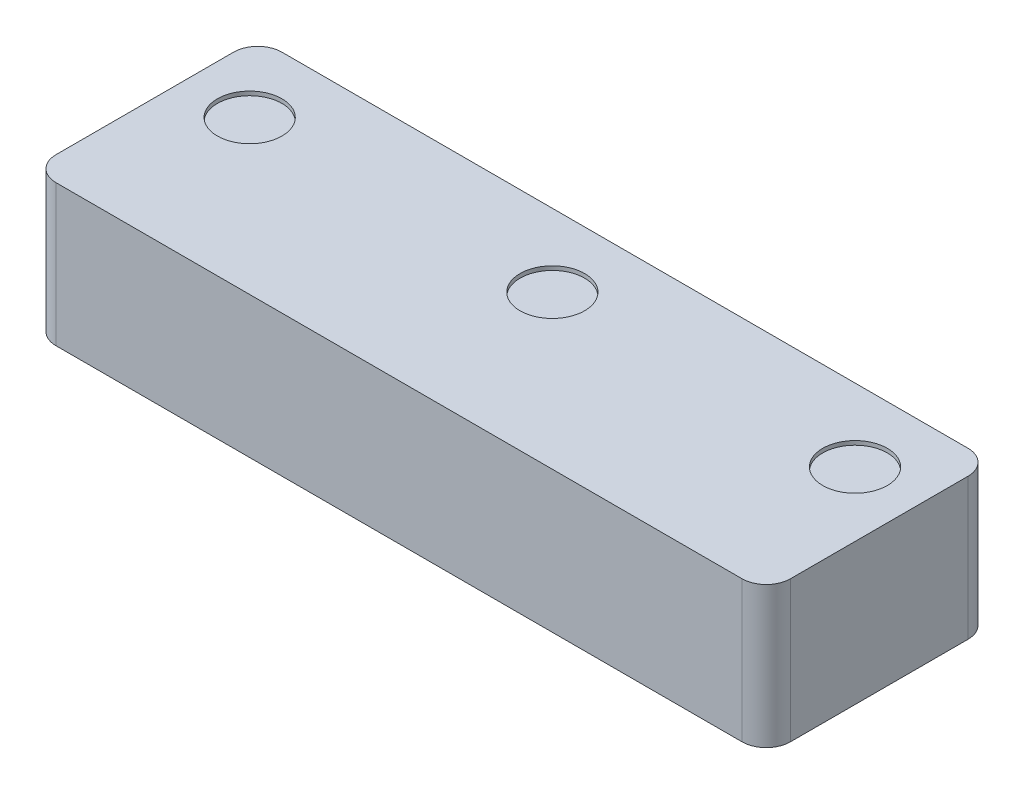
ISO-10303-21;
HEADER;
FILE_DESCRIPTION(('STEP AP214'),'2;1');
FILE_NAME('part.step','',(''),(''),'','','');
FILE_SCHEMA(('AUTOMOTIVE_DESIGN { 1 0 10303 214 1 1 1 1 }'));
ENDSEC;
DATA;
#1=APPLICATION_CONTEXT('core data for automotive mechanical design processes');
#2=APPLICATION_PROTOCOL_DEFINITION('international standard','automotive_design',2000,#1);
#3=PRODUCT_CONTEXT('',#1,'mechanical');
#4=PRODUCT('Part','Part','',(#3));
#5=PRODUCT_RELATED_PRODUCT_CATEGORY('part','',(#4));
#6=PRODUCT_DEFINITION_FORMATION('','',#4);
#7=PRODUCT_DEFINITION_CONTEXT('part definition',#1,'design');
#8=PRODUCT_DEFINITION('design','',#6,#7);
#9=PRODUCT_DEFINITION_SHAPE('','',#8);
#10=(LENGTH_UNIT() NAMED_UNIT(*) SI_UNIT(.MILLI.,.METRE.));
#11=(NAMED_UNIT(*) PLANE_ANGLE_UNIT() SI_UNIT($,.RADIAN.));
#12=(NAMED_UNIT(*) SI_UNIT($,.STERADIAN.) SOLID_ANGLE_UNIT());
#13=UNCERTAINTY_MEASURE_WITH_UNIT(LENGTH_MEASURE(1.E-05),#10,'distance_accuracy_value','');
#14=(GEOMETRIC_REPRESENTATION_CONTEXT(3) GLOBAL_UNCERTAINTY_ASSIGNED_CONTEXT((#13)) GLOBAL_UNIT_ASSIGNED_CONTEXT((#10,
#11,#12)) REPRESENTATION_CONTEXT('',''));
#15=CARTESIAN_POINT('',(0.,0.,0.));
#16=DIRECTION('',(0.,0.,1.));
#17=DIRECTION('',(1.,0.,0.));
#18=AXIS2_PLACEMENT_3D('',#15,#16,#17);
#19=CARTESIAN_POINT('',(0.,17.5,0.));
#20=DIRECTION('',(1.,0.,0.));
#21=DIRECTION('',(0.,0.,-1.));
#22=AXIS2_PLACEMENT_3D('',#19,#20,#21);
#23=PLANE('',#22);
#24=DIRECTION('',(0.,0.,1.));
#25=VECTOR('',#24,1.);
#26=CARTESIAN_POINT('',(0.,0.,0.));
#27=LINE('',#26,#25);
#28=CARTESIAN_POINT('',(0.,0.,-25.));
#29=VERTEX_POINT('',#28);
#30=CARTESIAN_POINT('',(0.,0.,-3.));
#31=VERTEX_POINT('',#30);
#32=EDGE_CURVE('E131',#29,#31,#27,.T.);
#33=ORIENTED_EDGE('',*,*,#32,.T.);
#34=DIRECTION('',(0.,-1.,0.));
#35=VECTOR('',#34,1.);
#36=CARTESIAN_POINT('',(0.,17.5,-3.));
#37=LINE('',#36,#35);
#38=CARTESIAN_POINT('',(0.,17.5,-3.));
#39=VERTEX_POINT('',#38);
#40=EDGE_CURVE('E108',#31,#39,#37,.F.);
#41=ORIENTED_EDGE('',*,*,#40,.T.);
#42=DIRECTION('',(0.,0.,1.));
#43=VECTOR('',#42,1.);
#44=CARTESIAN_POINT('',(0.,17.5,0.));
#45=LINE('',#44,#43);
#46=CARTESIAN_POINT('',(0.,17.5,-25.));
#47=VERTEX_POINT('',#46);
#48=EDGE_CURVE('E141',#47,#39,#45,.T.);
#49=ORIENTED_EDGE('',*,*,#48,.F.);
#50=DIRECTION('',(0.,-1.,0.));
#51=VECTOR('',#50,1.);
#52=CARTESIAN_POINT('',(0.,17.5,-25.));
#53=LINE('',#52,#51);
#54=EDGE_CURVE('E113',#47,#29,#53,.T.);
#55=ORIENTED_EDGE('',*,*,#54,.T.);
#56=EDGE_LOOP('',(#33,#41,#49,#55));
#57=FACE_BOUND('',#56,.T.);
#58=ADVANCED_FACE('F36',(#57),#23,.F.);
#59=CARTESIAN_POINT('',(0.,17.5,0.));
#60=DIRECTION('',(0.,0.,-1.));
#61=DIRECTION('',(-1.,0.,0.));
#62=AXIS2_PLACEMENT_3D('',#59,#60,#61);
#63=PLANE('',#62);
#64=DIRECTION('',(1.,0.,0.));
#65=VECTOR('',#64,1.);
#66=CARTESIAN_POINT('',(0.,17.5,0.));
#67=LINE('',#66,#65);
#68=CARTESIAN_POINT('',(3.,17.5,0.));
#69=VERTEX_POINT('',#68);
#70=CARTESIAN_POINT('',(88.,17.5,0.));
#71=VERTEX_POINT('',#70);
#72=EDGE_CURVE('E123',#69,#71,#67,.T.);
#73=ORIENTED_EDGE('',*,*,#72,.F.);
#74=DIRECTION('',(0.,-1.,0.));
#75=VECTOR('',#74,1.);
#76=CARTESIAN_POINT('',(3.,17.5,0.));
#77=LINE('',#76,#75);
#78=CARTESIAN_POINT('',(3.,0.,0.));
#79=VERTEX_POINT('',#78);
#80=EDGE_CURVE('E107',#69,#79,#77,.T.);
#81=ORIENTED_EDGE('',*,*,#80,.T.);
#82=DIRECTION('',(1.,0.,0.));
#83=VECTOR('',#82,1.);
#84=CARTESIAN_POINT('',(0.,0.,0.));
#85=LINE('',#84,#83);
#86=CARTESIAN_POINT('',(88.,0.,0.));
#87=VERTEX_POINT('',#86);
#88=EDGE_CURVE('E120',#79,#87,#85,.T.);
#89=ORIENTED_EDGE('',*,*,#88,.T.);
#90=DIRECTION('',(0.,-1.,0.));
#91=VECTOR('',#90,1.);
#92=CARTESIAN_POINT('',(88.,17.5,0.));
#93=LINE('',#92,#91);
#94=EDGE_CURVE('E125',#87,#71,#93,.F.);
#95=ORIENTED_EDGE('',*,*,#94,.T.);
#96=EDGE_LOOP('',(#73,#81,#89,#95));
#97=FACE_BOUND('',#96,.T.);
#98=ADVANCED_FACE('F119',(#97),#63,.F.);
#99=CARTESIAN_POINT('',(91.,17.5,0.));
#100=DIRECTION('',(-1.,0.,0.));
#101=DIRECTION('',(0.,0.,1.));
#102=AXIS2_PLACEMENT_3D('',#99,#100,#101);
#103=PLANE('',#102);
#104=DIRECTION('',(0.,0.,-1.));
#105=VECTOR('',#104,1.);
#106=CARTESIAN_POINT('',(91.,17.5,0.));
#107=LINE('',#106,#105);
#108=CARTESIAN_POINT('',(91.,17.5,-3.));
#109=VERTEX_POINT('',#108);
#110=CARTESIAN_POINT('',(91.,17.5,-25.));
#111=VERTEX_POINT('',#110);
#112=EDGE_CURVE('E164',#109,#111,#107,.T.);
#113=ORIENTED_EDGE('',*,*,#112,.F.);
#114=DIRECTION('',(0.,-1.,0.));
#115=VECTOR('',#114,1.);
#116=CARTESIAN_POINT('',(91.,17.5,-3.));
#117=LINE('',#116,#115);
#118=CARTESIAN_POINT('',(91.,0.,-3.));
#119=VERTEX_POINT('',#118);
#120=EDGE_CURVE('E11',#109,#119,#117,.T.);
#121=ORIENTED_EDGE('',*,*,#120,.T.);
#122=DIRECTION('',(0.,0.,-1.));
#123=VECTOR('',#122,1.);
#124=CARTESIAN_POINT('',(91.,0.,0.));
#125=LINE('',#124,#123);
#126=CARTESIAN_POINT('',(91.,0.,-25.));
#127=VERTEX_POINT('',#126);
#128=EDGE_CURVE('E130',#119,#127,#125,.T.);
#129=ORIENTED_EDGE('',*,*,#128,.T.);
#130=DIRECTION('',(0.,-1.,0.));
#131=VECTOR('',#130,1.);
#132=CARTESIAN_POINT('',(91.,17.5,-25.));
#133=LINE('',#132,#131);
#134=EDGE_CURVE('E44',#127,#111,#133,.F.);
#135=ORIENTED_EDGE('',*,*,#134,.T.);
#136=EDGE_LOOP('',(#113,#121,#129,#135));
#137=FACE_BOUND('',#136,.T.);
#138=ADVANCED_FACE('F163',(#137),#103,.F.);
#139=CARTESIAN_POINT('',(0.,17.5,-28.));
#140=DIRECTION('',(0.,0.,1.));
#141=DIRECTION('',(1.,0.,0.));
#142=AXIS2_PLACEMENT_3D('',#139,#140,#141);
#143=PLANE('',#142);
#144=DIRECTION('',(-1.,0.,0.));
#145=VECTOR('',#144,1.);
#146=CARTESIAN_POINT('',(0.,0.,-28.));
#147=LINE('',#146,#145);
#148=CARTESIAN_POINT('',(88.,0.,-28.));
#149=VERTEX_POINT('',#148);
#150=CARTESIAN_POINT('',(3.,0.,-28.));
#151=VERTEX_POINT('',#150);
#152=EDGE_CURVE('E134',#149,#151,#147,.T.);
#153=ORIENTED_EDGE('',*,*,#152,.T.);
#154=DIRECTION('',(0.,-1.,0.));
#155=VECTOR('',#154,1.);
#156=CARTESIAN_POINT('',(3.,17.5,-28.));
#157=LINE('',#156,#155);
#158=CARTESIAN_POINT('',(3.,17.5,-28.));
#159=VERTEX_POINT('',#158);
#160=EDGE_CURVE('E51',#151,#159,#157,.F.);
#161=ORIENTED_EDGE('',*,*,#160,.T.);
#162=DIRECTION('',(-1.,0.,0.));
#163=VECTOR('',#162,1.);
#164=CARTESIAN_POINT('',(0.,17.5,-28.));
#165=LINE('',#164,#163);
#166=CARTESIAN_POINT('',(88.,17.5,-28.));
#167=VERTEX_POINT('',#166);
#168=EDGE_CURVE('E142',#167,#159,#165,.T.);
#169=ORIENTED_EDGE('',*,*,#168,.F.);
#170=DIRECTION('',(0.,-1.,0.));
#171=VECTOR('',#170,1.);
#172=CARTESIAN_POINT('',(88.,17.5,-28.));
#173=LINE('',#172,#171);
#174=EDGE_CURVE('E157',#167,#149,#173,.T.);
#175=ORIENTED_EDGE('',*,*,#174,.T.);
#176=EDGE_LOOP('',(#153,#161,#169,#175));
#177=FACE_BOUND('',#176,.T.);
#178=ADVANCED_FACE('F173',(#177),#143,.F.);
#179=CARTESIAN_POINT('',(0.,17.5,0.));
#180=DIRECTION('',(0.,-1.,0.));
#181=DIRECTION('',(0.,0.,-1.));
#182=AXIS2_PLACEMENT_3D('',#179,#180,#181);
#183=PLANE('',#182);
#184=CARTESIAN_POINT('',(83.,17.5,-19.));
#185=DIRECTION('',(0.,1.,0.));
#186=DIRECTION('',(0.,0.,1.));
#187=AXIS2_PLACEMENT_3D('',#184,#185,#186);
#188=CIRCLE('',#187,4.00000000000001);
#189=CARTESIAN_POINT('',(83.,17.5,-15.));
#190=VERTEX_POINT('',#189);
#191=EDGE_CURVE('E189',#190,#190,#188,.T.);
#192=ORIENTED_EDGE('',*,*,#191,.F.);
#193=EDGE_LOOP('',(#192));
#194=FACE_BOUND('',#193,.T.);
#195=CARTESIAN_POINT('',(8.,17.5,-19.));
#196=DIRECTION('',(0.,1.,0.));
#197=DIRECTION('',(0.,0.,1.));
#198=AXIS2_PLACEMENT_3D('',#195,#196,#197);
#199=CIRCLE('',#198,4.);
#200=CARTESIAN_POINT('',(8.,17.5,-15.));
#201=VERTEX_POINT('',#200);
#202=EDGE_CURVE('E196',#201,#201,#199,.T.);
#203=ORIENTED_EDGE('',*,*,#202,.F.);
#204=EDGE_LOOP('',(#203));
#205=FACE_BOUND('',#204,.T.);
#206=CARTESIAN_POINT('',(45.5,17.5,-19.));
#207=DIRECTION('',(0.,1.,0.));
#208=DIRECTION('',(0.,0.,1.));
#209=AXIS2_PLACEMENT_3D('',#206,#207,#208);
#210=CIRCLE('',#209,4.00000000000001);
#211=CARTESIAN_POINT('',(45.5,17.5,-15.));
#212=VERTEX_POINT('',#211);
#213=EDGE_CURVE('E183',#212,#212,#210,.T.);
#214=ORIENTED_EDGE('',*,*,#213,.F.);
#215=EDGE_LOOP('',(#214));
#216=FACE_BOUND('',#215,.T.);
#217=ORIENTED_EDGE('',*,*,#48,.T.);
#218=CARTESIAN_POINT('',(3.,17.5,-3.));
#219=DIRECTION('',(0.,-1.,0.));
#220=DIRECTION('',(0.,0.,-1.));
#221=AXIS2_PLACEMENT_3D('',#218,#219,#220);
#222=CIRCLE('',#221,3.);
#223=EDGE_CURVE('E155',#39,#69,#222,.F.);
#224=ORIENTED_EDGE('',*,*,#223,.T.);
#225=ORIENTED_EDGE('',*,*,#72,.T.);
#226=CARTESIAN_POINT('',(88.,17.5,-3.));
#227=DIRECTION('',(0.,-1.,0.));
#228=DIRECTION('',(0.,0.,-1.));
#229=AXIS2_PLACEMENT_3D('',#226,#227,#228);
#230=CIRCLE('',#229,3.);
#231=EDGE_CURVE('E151',#71,#109,#230,.F.);
#232=ORIENTED_EDGE('',*,*,#231,.T.);
#233=ORIENTED_EDGE('',*,*,#112,.T.);
#234=CARTESIAN_POINT('',(88.,17.5,-25.));
#235=DIRECTION('',(0.,-1.,0.));
#236=DIRECTION('',(0.,0.,-1.));
#237=AXIS2_PLACEMENT_3D('',#234,#235,#236);
#238=CIRCLE('',#237,3.);
#239=EDGE_CURVE('E58',#111,#167,#238,.F.);
#240=ORIENTED_EDGE('',*,*,#239,.T.);
#241=ORIENTED_EDGE('',*,*,#168,.T.);
#242=CARTESIAN_POINT('',(3.,17.5,-25.));
#243=DIRECTION('',(0.,-1.,0.));
#244=DIRECTION('',(0.,0.,-1.));
#245=AXIS2_PLACEMENT_3D('',#242,#243,#244);
#246=CIRCLE('',#245,3.);
#247=EDGE_CURVE('E153',#159,#47,#246,.F.);
#248=ORIENTED_EDGE('',*,*,#247,.T.);
#249=EDGE_LOOP('',(#217,#224,#225,#232,#233,#240,#241,#248));
#250=FACE_BOUND('',#249,.T.);
#251=ADVANCED_FACE('F168',(#194,#205,#216,#250),#183,.F.);
#252=CARTESIAN_POINT('',(0.,0.,0.));
#253=DIRECTION('',(0.,-1.,0.));
#254=DIRECTION('',(0.,0.,-1.));
#255=AXIS2_PLACEMENT_3D('',#252,#253,#254);
#256=PLANE('',#255);
#257=CARTESIAN_POINT('',(83.,0.,-18.5));
#258=DIRECTION('',(0.,-1.,0.));
#259=DIRECTION('',(0.,0.,-1.));
#260=AXIS2_PLACEMENT_3D('',#257,#258,#259);
#261=CIRCLE('',#260,2.);
#262=CARTESIAN_POINT('',(83.,0.,-20.5));
#263=VERTEX_POINT('',#262);
#264=EDGE_CURVE('E207',#263,#263,#261,.T.);
#265=ORIENTED_EDGE('',*,*,#264,.F.);
#266=EDGE_LOOP('',(#265));
#267=FACE_BOUND('',#266,.T.);
#268=CARTESIAN_POINT('',(8.00000000000001,0.,-18.5));
#269=DIRECTION('',(0.,-1.,0.));
#270=DIRECTION('',(0.,0.,-1.));
#271=AXIS2_PLACEMENT_3D('',#268,#269,#270);
#272=CIRCLE('',#271,2.);
#273=CARTESIAN_POINT('',(8.00000000000001,0.,-20.5));
#274=VERTEX_POINT('',#273);
#275=EDGE_CURVE('E201',#274,#274,#272,.T.);
#276=ORIENTED_EDGE('',*,*,#275,.F.);
#277=EDGE_LOOP('',(#276));
#278=FACE_BOUND('',#277,.T.);
#279=ORIENTED_EDGE('',*,*,#88,.F.);
#280=CARTESIAN_POINT('',(3.,0.,-3.));
#281=DIRECTION('',(0.,-1.,0.));
#282=DIRECTION('',(0.,0.,-1.));
#283=AXIS2_PLACEMENT_3D('',#280,#281,#282);
#284=CIRCLE('',#283,3.);
#285=EDGE_CURVE('E103',#79,#31,#284,.T.);
#286=ORIENTED_EDGE('',*,*,#285,.T.);
#287=ORIENTED_EDGE('',*,*,#32,.F.);
#288=CARTESIAN_POINT('',(3.,0.,-25.));
#289=DIRECTION('',(0.,-1.,0.));
#290=DIRECTION('',(0.,0.,-1.));
#291=AXIS2_PLACEMENT_3D('',#288,#289,#290);
#292=CIRCLE('',#291,3.);
#293=EDGE_CURVE('E114',#29,#151,#292,.T.);
#294=ORIENTED_EDGE('',*,*,#293,.T.);
#295=ORIENTED_EDGE('',*,*,#152,.F.);
#296=CARTESIAN_POINT('',(88.,0.,-25.));
#297=DIRECTION('',(0.,-1.,0.));
#298=DIRECTION('',(0.,0.,-1.));
#299=AXIS2_PLACEMENT_3D('',#296,#297,#298);
#300=CIRCLE('',#299,3.);
#301=EDGE_CURVE('E124',#149,#127,#300,.T.);
#302=ORIENTED_EDGE('',*,*,#301,.T.);
#303=ORIENTED_EDGE('',*,*,#128,.F.);
#304=CARTESIAN_POINT('',(88.,0.,-3.));
#305=DIRECTION('',(0.,-1.,0.));
#306=DIRECTION('',(0.,0.,-1.));
#307=AXIS2_PLACEMENT_3D('',#304,#305,#306);
#308=CIRCLE('',#307,3.);
#309=EDGE_CURVE('E129',#119,#87,#308,.T.);
#310=ORIENTED_EDGE('',*,*,#309,.T.);
#311=EDGE_LOOP('',(#279,#286,#287,#294,#295,#302,#303,#310));
#312=FACE_BOUND('',#311,.T.);
#313=ADVANCED_FACE('F127',(#267,#278,#312),#256,.T.);
#314=CARTESIAN_POINT('',(45.5,17.,-19.));
#315=DIRECTION('',(0.,1.,0.));
#316=DIRECTION('',(0.,0.,1.));
#317=AXIS2_PLACEMENT_3D('',#314,#315,#316);
#318=CYLINDRICAL_SURFACE('',#317,4.00000000000001);
#319=CARTESIAN_POINT('',(45.5,17.,-19.));
#320=DIRECTION('',(0.,1.,0.));
#321=DIRECTION('',(0.,0.,1.));
#322=AXIS2_PLACEMENT_3D('',#319,#320,#321);
#323=CIRCLE('',#322,4.00000000000001);
#324=CARTESIAN_POINT('',(45.5,17.,-15.));
#325=VERTEX_POINT('',#324);
#326=EDGE_CURVE('E136',#325,#325,#323,.T.);
#327=ORIENTED_EDGE('',*,*,#326,.F.);
#328=EDGE_LOOP('',(#327));
#329=FACE_BOUND('',#328,.T.);
#330=ORIENTED_EDGE('',*,*,#213,.T.);
#331=EDGE_LOOP('',(#330));
#332=FACE_BOUND('',#331,.T.);
#333=ADVANCED_FACE('F224',(#329,#332),#318,.F.);
#334=CARTESIAN_POINT('',(45.5,17.,-19.));
#335=DIRECTION('',(0.,1.,0.));
#336=DIRECTION('',(0.,0.,1.));
#337=AXIS2_PLACEMENT_3D('',#334,#335,#336);
#338=PLANE('',#337);
#339=ORIENTED_EDGE('',*,*,#326,.T.);
#340=EDGE_LOOP('',(#339));
#341=FACE_BOUND('',#340,.T.);
#342=ADVANCED_FACE('F379',(#341),#338,.T.);
#343=CARTESIAN_POINT('',(8.,17.,-19.));
#344=DIRECTION('',(0.,1.,0.));
#345=DIRECTION('',(0.,0.,1.));
#346=AXIS2_PLACEMENT_3D('',#343,#344,#345);
#347=CYLINDRICAL_SURFACE('',#346,4.);
#348=CARTESIAN_POINT('',(8.,17.,-19.));
#349=DIRECTION('',(0.,1.,0.));
#350=DIRECTION('',(0.,0.,1.));
#351=AXIS2_PLACEMENT_3D('',#348,#349,#350);
#352=CIRCLE('',#351,4.);
#353=CARTESIAN_POINT('',(8.,17.,-15.));
#354=VERTEX_POINT('',#353);
#355=EDGE_CURVE('E186',#354,#354,#352,.T.);
#356=ORIENTED_EDGE('',*,*,#355,.F.);
#357=EDGE_LOOP('',(#356));
#358=FACE_BOUND('',#357,.T.);
#359=ORIENTED_EDGE('',*,*,#202,.T.);
#360=EDGE_LOOP('',(#359));
#361=FACE_BOUND('',#360,.T.);
#362=ADVANCED_FACE('F370',(#358,#361),#347,.F.);
#363=CARTESIAN_POINT('',(8.,17.,-19.));
#364=DIRECTION('',(0.,1.,0.));
#365=DIRECTION('',(0.,0.,1.));
#366=AXIS2_PLACEMENT_3D('',#363,#364,#365);
#367=PLANE('',#366);
#368=ORIENTED_EDGE('',*,*,#355,.T.);
#369=EDGE_LOOP('',(#368));
#370=FACE_BOUND('',#369,.T.);
#371=ADVANCED_FACE('F360',(#370),#367,.T.);
#372=CARTESIAN_POINT('',(83.,17.,-19.));
#373=DIRECTION('',(0.,1.,0.));
#374=DIRECTION('',(0.,0.,1.));
#375=AXIS2_PLACEMENT_3D('',#372,#373,#374);
#376=CYLINDRICAL_SURFACE('',#375,4.00000000000001);
#377=CARTESIAN_POINT('',(83.,17.,-19.));
#378=DIRECTION('',(0.,1.,0.));
#379=DIRECTION('',(0.,0.,1.));
#380=AXIS2_PLACEMENT_3D('',#377,#378,#379);
#381=CIRCLE('',#380,4.00000000000001);
#382=CARTESIAN_POINT('',(83.,17.,-15.));
#383=VERTEX_POINT('',#382);
#384=EDGE_CURVE('E192',#383,#383,#381,.T.);
#385=ORIENTED_EDGE('',*,*,#384,.F.);
#386=EDGE_LOOP('',(#385));
#387=FACE_BOUND('',#386,.T.);
#388=ORIENTED_EDGE('',*,*,#191,.T.);
#389=EDGE_LOOP('',(#388));
#390=FACE_BOUND('',#389,.T.);
#391=ADVANCED_FACE('F239',(#387,#390),#376,.F.);
#392=CARTESIAN_POINT('',(83.,17.,-19.));
#393=DIRECTION('',(0.,1.,0.));
#394=DIRECTION('',(0.,0.,1.));
#395=AXIS2_PLACEMENT_3D('',#392,#393,#394);
#396=PLANE('',#395);
#397=ORIENTED_EDGE('',*,*,#384,.T.);
#398=EDGE_LOOP('',(#397));
#399=FACE_BOUND('',#398,.T.);
#400=ADVANCED_FACE('F230',(#399),#396,.T.);
#401=CARTESIAN_POINT('',(8.00000000000001,6.5,-18.5));
#402=DIRECTION('',(0.,-1.,0.));
#403=DIRECTION('',(0.,0.,-1.));
#404=AXIS2_PLACEMENT_3D('',#401,#402,#403);
#405=CYLINDRICAL_SURFACE('',#404,2.);
#406=CARTESIAN_POINT('',(8.00000000000001,6.5,-18.5));
#407=DIRECTION('',(0.,-1.,0.));
#408=DIRECTION('',(0.,0.,-1.));
#409=AXIS2_PLACEMENT_3D('',#406,#407,#408);
#410=CIRCLE('',#409,2.);
#411=CARTESIAN_POINT('',(8.00000000000001,6.5,-20.5));
#412=VERTEX_POINT('',#411);
#413=EDGE_CURVE('E204',#412,#412,#410,.T.);
#414=ORIENTED_EDGE('',*,*,#413,.F.);
#415=EDGE_LOOP('',(#414));
#416=FACE_BOUND('',#415,.T.);
#417=ORIENTED_EDGE('',*,*,#275,.T.);
#418=EDGE_LOOP('',(#417));
#419=FACE_BOUND('',#418,.T.);
#420=ADVANCED_FACE('F228',(#416,#419),#405,.F.);
#421=CARTESIAN_POINT('',(8.00000000000001,6.5,-18.5));
#422=DIRECTION('',(0.,-1.,0.));
#423=DIRECTION('',(0.,0.,-1.));
#424=AXIS2_PLACEMENT_3D('',#421,#422,#423);
#425=PLANE('',#424);
#426=ORIENTED_EDGE('',*,*,#413,.T.);
#427=EDGE_LOOP('',(#426));
#428=FACE_BOUND('',#427,.T.);
#429=ADVANCED_FACE('F218',(#428),#425,.T.);
#430=CARTESIAN_POINT('',(83.,6.5,-18.5));
#431=DIRECTION('',(0.,-1.,0.));
#432=DIRECTION('',(0.,0.,-1.));
#433=AXIS2_PLACEMENT_3D('',#430,#431,#432);
#434=CYLINDRICAL_SURFACE('',#433,2.);
#435=CARTESIAN_POINT('',(83.,6.5,-18.5));
#436=DIRECTION('',(0.,-1.,0.));
#437=DIRECTION('',(0.,0.,-1.));
#438=AXIS2_PLACEMENT_3D('',#435,#436,#437);
#439=CIRCLE('',#438,2.);
#440=CARTESIAN_POINT('',(83.,6.5,-20.5));
#441=VERTEX_POINT('',#440);
#442=EDGE_CURVE('E193',#441,#441,#439,.T.);
#443=ORIENTED_EDGE('',*,*,#442,.F.);
#444=EDGE_LOOP('',(#443));
#445=FACE_BOUND('',#444,.T.);
#446=ORIENTED_EDGE('',*,*,#264,.T.);
#447=EDGE_LOOP('',(#446));
#448=FACE_BOUND('',#447,.T.);
#449=ADVANCED_FACE('F215',(#445,#448),#434,.F.);
#450=CARTESIAN_POINT('',(83.,6.5,-18.5));
#451=DIRECTION('',(0.,-1.,0.));
#452=DIRECTION('',(0.,0.,-1.));
#453=AXIS2_PLACEMENT_3D('',#450,#451,#452);
#454=PLANE('',#453);
#455=ORIENTED_EDGE('',*,*,#442,.T.);
#456=EDGE_LOOP('',(#455));
#457=FACE_BOUND('',#456,.T.);
#458=ADVANCED_FACE('F213',(#457),#454,.T.);
#459=CARTESIAN_POINT('',(3.,17.5,-3.));
#460=DIRECTION('',(0.,-1.,0.));
#461=DIRECTION('',(0.,0.,-1.));
#462=AXIS2_PLACEMENT_3D('',#459,#460,#461);
#463=CYLINDRICAL_SURFACE('',#462,3.);
#464=ORIENTED_EDGE('',*,*,#223,.F.);
#465=ORIENTED_EDGE('',*,*,#40,.F.);
#466=ORIENTED_EDGE('',*,*,#285,.F.);
#467=ORIENTED_EDGE('',*,*,#80,.F.);
#468=EDGE_LOOP('',(#464,#465,#466,#467));
#469=FACE_BOUND('',#468,.T.);
#470=ADVANCED_FACE('F106',(#469),#463,.T.);
#471=CARTESIAN_POINT('',(3.,17.5,-25.));
#472=DIRECTION('',(0.,-1.,0.));
#473=DIRECTION('',(0.,0.,-1.));
#474=AXIS2_PLACEMENT_3D('',#471,#472,#473);
#475=CYLINDRICAL_SURFACE('',#474,3.);
#476=ORIENTED_EDGE('',*,*,#247,.F.);
#477=ORIENTED_EDGE('',*,*,#160,.F.);
#478=ORIENTED_EDGE('',*,*,#293,.F.);
#479=ORIENTED_EDGE('',*,*,#54,.F.);
#480=EDGE_LOOP('',(#476,#477,#478,#479));
#481=FACE_BOUND('',#480,.T.);
#482=ADVANCED_FACE('F177',(#481),#475,.T.);
#483=CARTESIAN_POINT('',(88.,17.5,-3.));
#484=DIRECTION('',(0.,-1.,0.));
#485=DIRECTION('',(0.,0.,-1.));
#486=AXIS2_PLACEMENT_3D('',#483,#484,#485);
#487=CYLINDRICAL_SURFACE('',#486,3.);
#488=ORIENTED_EDGE('',*,*,#231,.F.);
#489=ORIENTED_EDGE('',*,*,#94,.F.);
#490=ORIENTED_EDGE('',*,*,#309,.F.);
#491=ORIENTED_EDGE('',*,*,#120,.F.);
#492=EDGE_LOOP('',(#488,#489,#490,#491));
#493=FACE_BOUND('',#492,.T.);
#494=ADVANCED_FACE('F255',(#493),#487,.T.);
#495=CARTESIAN_POINT('',(88.,17.5,-25.));
#496=DIRECTION('',(0.,-1.,0.));
#497=DIRECTION('',(0.,0.,-1.));
#498=AXIS2_PLACEMENT_3D('',#495,#496,#497);
#499=CYLINDRICAL_SURFACE('',#498,3.);
#500=ORIENTED_EDGE('',*,*,#239,.F.);
#501=ORIENTED_EDGE('',*,*,#134,.F.);
#502=ORIENTED_EDGE('',*,*,#301,.F.);
#503=ORIENTED_EDGE('',*,*,#174,.F.);
#504=EDGE_LOOP('',(#500,#501,#502,#503));
#505=FACE_BOUND('',#504,.T.);
#506=ADVANCED_FACE('F38',(#505),#499,.T.);
#507=CLOSED_SHELL('',(#58,#98,#138,#178,#251,#313,#333,#342,#362,#371,#391,#400,#420,#429,#449,
#458,#470,#482,#494,#506));
#508=MANIFOLD_SOLID_BREP('B2',#507);
#509=ADVANCED_BREP_SHAPE_REPRESENTATION('',(#18,#508),#14);
#510=SHAPE_DEFINITION_REPRESENTATION(#9,#509);
ENDSEC;
END-ISO-10303-21;
